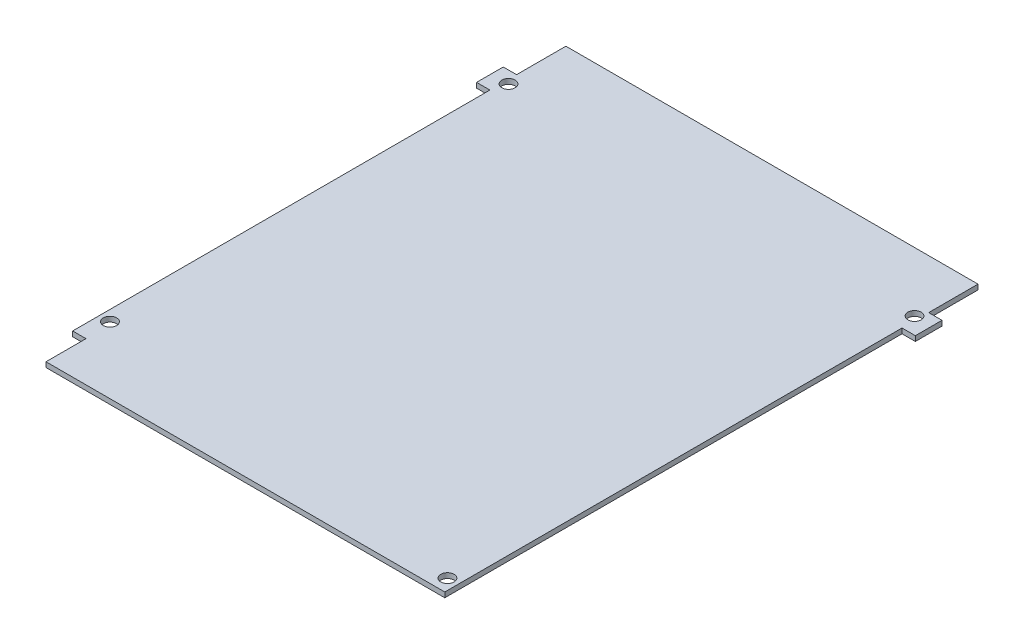
ISO-10303-21;
HEADER;
FILE_DESCRIPTION(('STEP AP214'),'2;1');
FILE_NAME('part.step','',(''),(''),'','','');
FILE_SCHEMA(('AUTOMOTIVE_DESIGN { 1 0 10303 214 1 1 1 1 }'));
ENDSEC;
DATA;
#1=APPLICATION_CONTEXT('core data for automotive mechanical design processes');
#2=APPLICATION_PROTOCOL_DEFINITION('international standard','automotive_design',2000,#1);
#3=PRODUCT_CONTEXT('',#1,'mechanical');
#4=PRODUCT('Part','Part','',(#3));
#5=PRODUCT_RELATED_PRODUCT_CATEGORY('part','',(#4));
#6=PRODUCT_DEFINITION_FORMATION('','',#4);
#7=PRODUCT_DEFINITION_CONTEXT('part definition',#1,'design');
#8=PRODUCT_DEFINITION('design','',#6,#7);
#9=PRODUCT_DEFINITION_SHAPE('','',#8);
#10=(LENGTH_UNIT() NAMED_UNIT(*) SI_UNIT(.MILLI.,.METRE.));
#11=(NAMED_UNIT(*) PLANE_ANGLE_UNIT() SI_UNIT($,.RADIAN.));
#12=(NAMED_UNIT(*) SI_UNIT($,.STERADIAN.) SOLID_ANGLE_UNIT());
#13=UNCERTAINTY_MEASURE_WITH_UNIT(LENGTH_MEASURE(1.E-05),#10,'distance_accuracy_value','');
#14=(GEOMETRIC_REPRESENTATION_CONTEXT(3) GLOBAL_UNCERTAINTY_ASSIGNED_CONTEXT((#13)) GLOBAL_UNIT_ASSIGNED_CONTEXT((#10,
#11,#12)) REPRESENTATION_CONTEXT('',''));
#15=CARTESIAN_POINT('',(0.,0.,0.));
#16=DIRECTION('',(0.,0.,1.));
#17=DIRECTION('',(1.,0.,0.));
#18=AXIS2_PLACEMENT_3D('',#15,#16,#17);
#19=CARTESIAN_POINT('',(-111.528776978417,-1.89738,-52.7517985611511));
#20=DIRECTION('',(-1.,0.,0.));
#21=DIRECTION('',(0.,0.,1.));
#22=AXIS2_PLACEMENT_3D('',#19,#20,#21);
#23=PLANE('',#22);
#24=DIRECTION('',(0.,0.,1.));
#25=VECTOR('',#24,1.);
#26=CARTESIAN_POINT('',(-111.528776978417,0.,-52.7517985611511));
#27=LINE('',#26,#25);
#28=CARTESIAN_POINT('',(-111.528776978417,0.,-52.7517985611511));
#29=VERTEX_POINT('',#28);
#30=CARTESIAN_POINT('',(-111.528776978417,0.,-34.2517985611511));
#31=VERTEX_POINT('',#30);
#32=EDGE_CURVE('E166',#29,#31,#27,.T.);
#33=ORIENTED_EDGE('',*,*,#32,.F.);
#34=DIRECTION('',(0.,1.,0.));
#35=VECTOR('',#34,1.);
#36=CARTESIAN_POINT('',(-111.528776978417,-1.89738,-52.7517985611511));
#37=LINE('',#36,#35);
#38=CARTESIAN_POINT('',(-111.528776978417,-1.89738,-52.7517985611511));
#39=VERTEX_POINT('',#38);
#40=EDGE_CURVE('E11',#39,#29,#37,.T.);
#41=ORIENTED_EDGE('',*,*,#40,.F.);
#42=DIRECTION('',(0.,0.,1.));
#43=VECTOR('',#42,1.);
#44=CARTESIAN_POINT('',(-111.528776978417,-1.89738,-52.7517985611511));
#45=LINE('',#44,#43);
#46=CARTESIAN_POINT('',(-111.528776978417,-1.89738,-34.2517985611511));
#47=VERTEX_POINT('',#46);
#48=EDGE_CURVE('E198',#39,#47,#45,.T.);
#49=ORIENTED_EDGE('',*,*,#48,.T.);
#50=DIRECTION('',(0.,1.,0.));
#51=VECTOR('',#50,1.);
#52=CARTESIAN_POINT('',(-111.528776978417,-1.89738,-34.2517985611511));
#53=LINE('',#52,#51);
#54=EDGE_CURVE('E40',#47,#31,#53,.T.);
#55=ORIENTED_EDGE('',*,*,#54,.T.);
#56=EDGE_LOOP('',(#33,#41,#49,#55));
#57=FACE_BOUND('',#56,.T.);
#58=ADVANCED_FACE('F37',(#57),#23,.T.);
#59=CARTESIAN_POINT('',(-111.528776978417,-1.89738,-52.7517985611511));
#60=DIRECTION('',(0.,0.,-1.));
#61=DIRECTION('',(-1.,0.,0.));
#62=AXIS2_PLACEMENT_3D('',#59,#60,#61);
#63=PLANE('',#62);
#64=DIRECTION('',(-1.,0.,0.));
#65=VECTOR('',#64,1.);
#66=CARTESIAN_POINT('',(-111.528776978417,0.,-52.7517985611511));
#67=LINE('',#66,#65);
#68=CARTESIAN_POINT('',(43.0412230215827,0.,-52.7517985611511));
#69=VERTEX_POINT('',#68);
#70=EDGE_CURVE('E196',#69,#29,#67,.T.);
#71=ORIENTED_EDGE('',*,*,#70,.F.);
#72=DIRECTION('',(0.,1.,0.));
#73=VECTOR('',#72,1.);
#74=CARTESIAN_POINT('',(43.0412230215827,-1.89738,-52.7517985611511));
#75=LINE('',#74,#73);
#76=CARTESIAN_POINT('',(43.0412230215827,-1.89738,-52.7517985611511));
#77=VERTEX_POINT('',#76);
#78=EDGE_CURVE('E45',#77,#69,#75,.T.);
#79=ORIENTED_EDGE('',*,*,#78,.F.);
#80=DIRECTION('',(-1.,0.,0.));
#81=VECTOR('',#80,1.);
#82=CARTESIAN_POINT('',(-111.528776978417,-1.89738,-52.7517985611511));
#83=LINE('',#82,#81);
#84=EDGE_CURVE('E156',#77,#39,#83,.T.);
#85=ORIENTED_EDGE('',*,*,#84,.T.);
#86=ORIENTED_EDGE('',*,*,#40,.T.);
#87=EDGE_LOOP('',(#71,#79,#85,#86));
#88=FACE_BOUND('',#87,.T.);
#89=ADVANCED_FACE('F217',(#88),#63,.T.);
#90=CARTESIAN_POINT('',(43.0412230215827,-1.89738,-52.7517985611511));
#91=DIRECTION('',(1.,0.,0.));
#92=DIRECTION('',(0.,0.,-1.));
#93=AXIS2_PLACEMENT_3D('',#90,#91,#92);
#94=PLANE('',#93);
#95=DIRECTION('',(0.,0.,-1.));
#96=VECTOR('',#95,1.);
#97=CARTESIAN_POINT('',(43.0412230215827,0.,-52.7517985611511));
#98=LINE('',#97,#96);
#99=CARTESIAN_POINT('',(43.0412230215827,0.,-34.2517985611511));
#100=VERTEX_POINT('',#99);
#101=EDGE_CURVE('E141',#100,#69,#98,.T.);
#102=ORIENTED_EDGE('',*,*,#101,.F.);
#103=DIRECTION('',(0.,1.,0.));
#104=VECTOR('',#103,1.);
#105=CARTESIAN_POINT('',(43.0412230215827,-1.89738,-34.2517985611511));
#106=LINE('',#105,#104);
#107=CARTESIAN_POINT('',(43.0412230215827,-1.89738,-34.2517985611511));
#108=VERTEX_POINT('',#107);
#109=EDGE_CURVE('E135',#108,#100,#106,.T.);
#110=ORIENTED_EDGE('',*,*,#109,.F.);
#111=DIRECTION('',(0.,0.,-1.));
#112=VECTOR('',#111,1.);
#113=CARTESIAN_POINT('',(43.0412230215827,-1.89738,-52.7517985611511));
#114=LINE('',#113,#112);
#115=EDGE_CURVE('E138',#108,#77,#114,.T.);
#116=ORIENTED_EDGE('',*,*,#115,.T.);
#117=ORIENTED_EDGE('',*,*,#78,.T.);
#118=EDGE_LOOP('',(#102,#110,#116,#117));
#119=FACE_BOUND('',#118,.T.);
#120=ADVANCED_FACE('F137',(#119),#94,.T.);
#121=CARTESIAN_POINT('',(43.0412230215827,-1.89738,-34.2517985611511));
#122=DIRECTION('',(0.,0.,-1.));
#123=DIRECTION('',(-1.,0.,0.));
#124=AXIS2_PLACEMENT_3D('',#121,#122,#123);
#125=PLANE('',#124);
#126=DIRECTION('',(-1.,0.,0.));
#127=VECTOR('',#126,1.);
#128=CARTESIAN_POINT('',(43.0412230215827,0.,-34.2517985611511));
#129=LINE('',#128,#127);
#130=CARTESIAN_POINT('',(48.0412230215827,0.,-34.2517985611511));
#131=VERTEX_POINT('',#130);
#132=EDGE_CURVE('E193',#131,#100,#129,.T.);
#133=ORIENTED_EDGE('',*,*,#132,.F.);
#134=DIRECTION('',(0.,1.,0.));
#135=VECTOR('',#134,1.);
#136=CARTESIAN_POINT('',(48.0412230215827,-1.89738,-34.2517985611511));
#137=LINE('',#136,#135);
#138=CARTESIAN_POINT('',(48.0412230215827,-1.89738,-34.2517985611511));
#139=VERTEX_POINT('',#138);
#140=EDGE_CURVE('E146',#139,#131,#137,.T.);
#141=ORIENTED_EDGE('',*,*,#140,.F.);
#142=DIRECTION('',(-1.,0.,0.));
#143=VECTOR('',#142,1.);
#144=CARTESIAN_POINT('',(43.0412230215827,-1.89738,-34.2517985611511));
#145=LINE('',#144,#143);
#146=EDGE_CURVE('E154',#139,#108,#145,.T.);
#147=ORIENTED_EDGE('',*,*,#146,.T.);
#148=ORIENTED_EDGE('',*,*,#109,.T.);
#149=EDGE_LOOP('',(#133,#141,#147,#148));
#150=FACE_BOUND('',#149,.T.);
#151=ADVANCED_FACE('F158',(#150),#125,.T.);
#152=CARTESIAN_POINT('',(48.0412230215827,-1.89738,-34.2517985611511));
#153=DIRECTION('',(1.,0.,0.));
#154=DIRECTION('',(0.,0.,-1.));
#155=AXIS2_PLACEMENT_3D('',#152,#153,#154);
#156=PLANE('',#155);
#157=DIRECTION('',(0.,0.,-1.));
#158=VECTOR('',#157,1.);
#159=CARTESIAN_POINT('',(48.0412230215827,0.,-34.2517985611511));
#160=LINE('',#159,#158);
#161=CARTESIAN_POINT('',(48.0412230215827,0.,-24.2517985611511));
#162=VERTEX_POINT('',#161);
#163=EDGE_CURVE('E190',#162,#131,#160,.T.);
#164=ORIENTED_EDGE('',*,*,#163,.F.);
#165=DIRECTION('',(0.,1.,0.));
#166=VECTOR('',#165,1.);
#167=CARTESIAN_POINT('',(48.0412230215827,-1.89738,-24.2517985611511));
#168=LINE('',#167,#166);
#169=CARTESIAN_POINT('',(48.0412230215827,-1.89738,-24.2517985611511));
#170=VERTEX_POINT('',#169);
#171=EDGE_CURVE('E202',#170,#162,#168,.T.);
#172=ORIENTED_EDGE('',*,*,#171,.F.);
#173=DIRECTION('',(0.,0.,-1.));
#174=VECTOR('',#173,1.);
#175=CARTESIAN_POINT('',(48.0412230215827,-1.89738,-34.2517985611511));
#176=LINE('',#175,#174);
#177=EDGE_CURVE('E159',#170,#139,#176,.T.);
#178=ORIENTED_EDGE('',*,*,#177,.T.);
#179=ORIENTED_EDGE('',*,*,#140,.T.);
#180=EDGE_LOOP('',(#164,#172,#178,#179));
#181=FACE_BOUND('',#180,.T.);
#182=ADVANCED_FACE('F230',(#181),#156,.T.);
#183=CARTESIAN_POINT('',(48.0412230215827,-1.89738,-24.2517985611511));
#184=DIRECTION('',(0.,0.,1.));
#185=DIRECTION('',(1.,0.,0.));
#186=AXIS2_PLACEMENT_3D('',#183,#184,#185);
#187=PLANE('',#186);
#188=DIRECTION('',(1.,0.,0.));
#189=VECTOR('',#188,1.);
#190=CARTESIAN_POINT('',(48.0412230215827,0.,-24.2517985611511));
#191=LINE('',#190,#189);
#192=CARTESIAN_POINT('',(43.0412230215827,0.,-24.2517985611511));
#193=VERTEX_POINT('',#192);
#194=EDGE_CURVE('E187',#193,#162,#191,.T.);
#195=ORIENTED_EDGE('',*,*,#194,.F.);
#196=DIRECTION('',(0.,1.,0.));
#197=VECTOR('',#196,1.);
#198=CARTESIAN_POINT('',(43.0412230215827,-1.89738,-24.2517985611511));
#199=LINE('',#198,#197);
#200=CARTESIAN_POINT('',(43.0412230215827,-1.89738,-24.2517985611511));
#201=VERTEX_POINT('',#200);
#202=EDGE_CURVE('E204',#201,#193,#199,.T.);
#203=ORIENTED_EDGE('',*,*,#202,.F.);
#204=DIRECTION('',(1.,0.,0.));
#205=VECTOR('',#204,1.);
#206=CARTESIAN_POINT('',(48.0412230215827,-1.89738,-24.2517985611511));
#207=LINE('',#206,#205);
#208=EDGE_CURVE('E161',#201,#170,#207,.T.);
#209=ORIENTED_EDGE('',*,*,#208,.T.);
#210=ORIENTED_EDGE('',*,*,#171,.T.);
#211=EDGE_LOOP('',(#195,#203,#209,#210));
#212=FACE_BOUND('',#211,.T.);
#213=ADVANCED_FACE('F233',(#212),#187,.T.);
#214=CARTESIAN_POINT('',(43.0412230215827,-1.89738,-24.2517985611511));
#215=DIRECTION('',(1.,0.,0.));
#216=DIRECTION('',(0.,0.,-1.));
#217=AXIS2_PLACEMENT_3D('',#214,#215,#216);
#218=PLANE('',#217);
#219=DIRECTION('',(0.,0.,-1.));
#220=VECTOR('',#219,1.);
#221=CARTESIAN_POINT('',(43.0412230215827,0.,-24.2517985611511));
#222=LINE('',#221,#220);
#223=CARTESIAN_POINT('',(43.0412230215828,0.,147.248201438849));
#224=VERTEX_POINT('',#223);
#225=EDGE_CURVE('E184',#224,#193,#222,.T.);
#226=ORIENTED_EDGE('',*,*,#225,.F.);
#227=DIRECTION('',(0.,1.,0.));
#228=VECTOR('',#227,1.);
#229=CARTESIAN_POINT('',(43.0412230215828,-1.89738,147.248201438849));
#230=LINE('',#229,#228);
#231=CARTESIAN_POINT('',(43.0412230215828,-1.89738,147.248201438849));
#232=VERTEX_POINT('',#231);
#233=EDGE_CURVE('E206',#232,#224,#230,.T.);
#234=ORIENTED_EDGE('',*,*,#233,.F.);
#235=DIRECTION('',(0.,0.,-1.));
#236=VECTOR('',#235,1.);
#237=CARTESIAN_POINT('',(43.0412230215827,-1.89738,-24.2517985611511));
#238=LINE('',#237,#236);
#239=EDGE_CURVE('E352',#232,#201,#238,.T.);
#240=ORIENTED_EDGE('',*,*,#239,.T.);
#241=ORIENTED_EDGE('',*,*,#202,.T.);
#242=EDGE_LOOP('',(#226,#234,#240,#241));
#243=FACE_BOUND('',#242,.T.);
#244=ADVANCED_FACE('F237',(#243),#218,.T.);
#245=CARTESIAN_POINT('',(-111.528776978417,-1.89738,147.248201438849));
#246=DIRECTION('',(0.,0.,1.));
#247=DIRECTION('',(1.,0.,0.));
#248=AXIS2_PLACEMENT_3D('',#245,#246,#247);
#249=PLANE('',#248);
#250=DIRECTION('',(0.,1.,0.));
#251=VECTOR('',#250,1.);
#252=CARTESIAN_POINT('',(-106.528776978417,-10.,147.248201438849));
#253=LINE('',#252,#251);
#254=CARTESIAN_POINT('',(-106.528776978417,-1.89738,147.248201438849));
#255=VERTEX_POINT('',#254);
#256=CARTESIAN_POINT('',(-106.528776978417,0.,147.248201438849));
#257=VERTEX_POINT('',#256);
#258=EDGE_CURVE('E53',#255,#257,#253,.T.);
#259=ORIENTED_EDGE('',*,*,#258,.F.);
#260=DIRECTION('',(1.,0.,0.));
#261=VECTOR('',#260,1.);
#262=CARTESIAN_POINT('',(-111.528776978417,-1.89738,147.248201438849));
#263=LINE('',#262,#261);
#264=EDGE_CURVE('E313',#255,#232,#263,.T.);
#265=ORIENTED_EDGE('',*,*,#264,.T.);
#266=ORIENTED_EDGE('',*,*,#233,.T.);
#267=DIRECTION('',(1.,0.,0.));
#268=VECTOR('',#267,1.);
#269=CARTESIAN_POINT('',(-111.528776978417,0.,147.248201438849));
#270=LINE('',#269,#268);
#271=EDGE_CURVE('E182',#257,#224,#270,.T.);
#272=ORIENTED_EDGE('',*,*,#271,.F.);
#273=EDGE_LOOP('',(#259,#265,#266,#272));
#274=FACE_BOUND('',#273,.T.);
#275=ADVANCED_FACE('F241',(#274),#249,.T.);
#276=CARTESIAN_POINT('',(-111.528776978417,-1.89738,-24.2517985611511));
#277=DIRECTION('',(-1.,0.,0.));
#278=DIRECTION('',(0.,0.,1.));
#279=AXIS2_PLACEMENT_3D('',#276,#277,#278);
#280=PLANE('',#279);
#281=DIRECTION('',(0.,1.,0.));
#282=VECTOR('',#281,1.);
#283=CARTESIAN_POINT('',(-111.528776978417,-10.,132.248201438849));
#284=LINE('',#283,#282);
#285=CARTESIAN_POINT('',(-111.528776978417,-1.89738,132.248201438849));
#286=VERTEX_POINT('',#285);
#287=CARTESIAN_POINT('',(-111.528776978417,0.,132.248201438849));
#288=VERTEX_POINT('',#287);
#289=EDGE_CURVE('E300',#286,#288,#284,.T.);
#290=ORIENTED_EDGE('',*,*,#289,.T.);
#291=DIRECTION('',(0.,0.,1.));
#292=VECTOR('',#291,1.);
#293=CARTESIAN_POINT('',(-111.528776978417,0.,-24.2517985611511));
#294=LINE('',#293,#292);
#295=CARTESIAN_POINT('',(-111.528776978417,0.,-24.2517985611511));
#296=VERTEX_POINT('',#295);
#297=EDGE_CURVE('E179',#296,#288,#294,.T.);
#298=ORIENTED_EDGE('',*,*,#297,.F.);
#299=DIRECTION('',(0.,1.,0.));
#300=VECTOR('',#299,1.);
#301=CARTESIAN_POINT('',(-111.528776978417,-1.89738,-24.2517985611511));
#302=LINE('',#301,#300);
#303=CARTESIAN_POINT('',(-111.528776978417,-1.89738,-24.2517985611511));
#304=VERTEX_POINT('',#303);
#305=EDGE_CURVE('E209',#304,#296,#302,.T.);
#306=ORIENTED_EDGE('',*,*,#305,.F.);
#307=DIRECTION('',(0.,0.,1.));
#308=VECTOR('',#307,1.);
#309=CARTESIAN_POINT('',(-111.528776978417,-1.89738,-24.2517985611511));
#310=LINE('',#309,#308);
#311=EDGE_CURVE('E349',#304,#286,#310,.T.);
#312=ORIENTED_EDGE('',*,*,#311,.T.);
#313=EDGE_LOOP('',(#290,#298,#306,#312));
#314=FACE_BOUND('',#313,.T.);
#315=ADVANCED_FACE('F245',(#314),#280,.T.);
#316=CARTESIAN_POINT('',(-116.528776978417,-1.89738,-24.2517985611511));
#317=DIRECTION('',(0.,0.,1.));
#318=DIRECTION('',(1.,0.,0.));
#319=AXIS2_PLACEMENT_3D('',#316,#317,#318);
#320=PLANE('',#319);
#321=DIRECTION('',(1.,0.,0.));
#322=VECTOR('',#321,1.);
#323=CARTESIAN_POINT('',(-116.528776978417,0.,-24.2517985611511));
#324=LINE('',#323,#322);
#325=CARTESIAN_POINT('',(-116.528776978417,0.,-24.2517985611511));
#326=VERTEX_POINT('',#325);
#327=EDGE_CURVE('E176',#326,#296,#324,.T.);
#328=ORIENTED_EDGE('',*,*,#327,.F.);
#329=DIRECTION('',(0.,1.,0.));
#330=VECTOR('',#329,1.);
#331=CARTESIAN_POINT('',(-116.528776978417,-1.89738,-24.2517985611511));
#332=LINE('',#331,#330);
#333=CARTESIAN_POINT('',(-116.528776978417,-1.89738,-24.2517985611511));
#334=VERTEX_POINT('',#333);
#335=EDGE_CURVE('E211',#334,#326,#332,.T.);
#336=ORIENTED_EDGE('',*,*,#335,.F.);
#337=DIRECTION('',(1.,0.,0.));
#338=VECTOR('',#337,1.);
#339=CARTESIAN_POINT('',(-116.528776978417,-1.89738,-24.2517985611511));
#340=LINE('',#339,#338);
#341=EDGE_CURVE('E346',#334,#304,#340,.T.);
#342=ORIENTED_EDGE('',*,*,#341,.T.);
#343=ORIENTED_EDGE('',*,*,#305,.T.);
#344=EDGE_LOOP('',(#328,#336,#342,#343));
#345=FACE_BOUND('',#344,.T.);
#346=ADVANCED_FACE('F249',(#345),#320,.T.);
#347=CARTESIAN_POINT('',(-116.528776978417,-1.89738,-34.2517985611511));
#348=DIRECTION('',(-1.,0.,0.));
#349=DIRECTION('',(0.,0.,1.));
#350=AXIS2_PLACEMENT_3D('',#347,#348,#349);
#351=PLANE('',#350);
#352=DIRECTION('',(0.,0.,1.));
#353=VECTOR('',#352,1.);
#354=CARTESIAN_POINT('',(-116.528776978417,0.,-34.2517985611511));
#355=LINE('',#354,#353);
#356=CARTESIAN_POINT('',(-116.528776978417,0.,-34.2517985611511));
#357=VERTEX_POINT('',#356);
#358=EDGE_CURVE('E173',#357,#326,#355,.T.);
#359=ORIENTED_EDGE('',*,*,#358,.F.);
#360=DIRECTION('',(0.,1.,0.));
#361=VECTOR('',#360,1.);
#362=CARTESIAN_POINT('',(-116.528776978417,-1.89738,-34.2517985611511));
#363=LINE('',#362,#361);
#364=CARTESIAN_POINT('',(-116.528776978417,-1.89738,-34.2517985611511));
#365=VERTEX_POINT('',#364);
#366=EDGE_CURVE('E212',#365,#357,#363,.T.);
#367=ORIENTED_EDGE('',*,*,#366,.F.);
#368=DIRECTION('',(0.,0.,1.));
#369=VECTOR('',#368,1.);
#370=CARTESIAN_POINT('',(-116.528776978417,-1.89738,-34.2517985611511));
#371=LINE('',#370,#369);
#372=EDGE_CURVE('E343',#365,#334,#371,.T.);
#373=ORIENTED_EDGE('',*,*,#372,.T.);
#374=ORIENTED_EDGE('',*,*,#335,.T.);
#375=EDGE_LOOP('',(#359,#367,#373,#374));
#376=FACE_BOUND('',#375,.T.);
#377=ADVANCED_FACE('F253',(#376),#351,.T.);
#378=CARTESIAN_POINT('',(-111.528776978417,-1.89738,-34.2517985611511));
#379=DIRECTION('',(0.,0.,-1.));
#380=DIRECTION('',(-1.,0.,0.));
#381=AXIS2_PLACEMENT_3D('',#378,#379,#380);
#382=PLANE('',#381);
#383=DIRECTION('',(-1.,0.,0.));
#384=VECTOR('',#383,1.);
#385=CARTESIAN_POINT('',(-111.528776978417,0.,-34.2517985611511));
#386=LINE('',#385,#384);
#387=EDGE_CURVE('E169',#31,#357,#386,.T.);
#388=ORIENTED_EDGE('',*,*,#387,.F.);
#389=ORIENTED_EDGE('',*,*,#54,.F.);
#390=DIRECTION('',(-1.,0.,0.));
#391=VECTOR('',#390,1.);
#392=CARTESIAN_POINT('',(-111.528776978417,-1.89738,-34.2517985611511));
#393=LINE('',#392,#391);
#394=EDGE_CURVE('E341',#47,#365,#393,.T.);
#395=ORIENTED_EDGE('',*,*,#394,.T.);
#396=ORIENTED_EDGE('',*,*,#366,.T.);
#397=EDGE_LOOP('',(#388,#389,#395,#396));
#398=FACE_BOUND('',#397,.T.);
#399=ADVANCED_FACE('F214',(#398),#382,.T.);
#400=CARTESIAN_POINT('',(0.,-1.89738,0.));
#401=DIRECTION('',(0.,-1.,0.));
#402=DIRECTION('',(0.,0.,-1.));
#403=AXIS2_PLACEMENT_3D('',#400,#401,#402);
#404=PLANE('',#403);
#405=DIRECTION('',(1.,0.,0.));
#406=VECTOR('',#405,1.);
#407=CARTESIAN_POINT('',(0.,-1.89738,132.248201438849));
#408=LINE('',#407,#406);
#409=CARTESIAN_POINT('',(-106.528776978417,-1.89738,132.248201438849));
#410=VERTEX_POINT('',#409);
#411=EDGE_CURVE('E294',#286,#410,#408,.T.);
#412=ORIENTED_EDGE('',*,*,#411,.F.);
#413=ORIENTED_EDGE('',*,*,#311,.F.);
#414=ORIENTED_EDGE('',*,*,#341,.F.);
#415=ORIENTED_EDGE('',*,*,#372,.F.);
#416=ORIENTED_EDGE('',*,*,#394,.F.);
#417=ORIENTED_EDGE('',*,*,#48,.F.);
#418=ORIENTED_EDGE('',*,*,#84,.F.);
#419=ORIENTED_EDGE('',*,*,#115,.F.);
#420=ORIENTED_EDGE('',*,*,#146,.F.);
#421=ORIENTED_EDGE('',*,*,#177,.F.);
#422=ORIENTED_EDGE('',*,*,#208,.F.);
#423=ORIENTED_EDGE('',*,*,#239,.F.);
#424=ORIENTED_EDGE('',*,*,#264,.F.);
#425=DIRECTION('',(0.,0.,1.));
#426=VECTOR('',#425,1.);
#427=CARTESIAN_POINT('',(-106.528776978417,-1.89738,0.));
#428=LINE('',#427,#426);
#429=EDGE_CURVE('E306',#410,#255,#428,.T.);
#430=ORIENTED_EDGE('',*,*,#429,.F.);
#431=EDGE_LOOP('',(#412,#413,#414,#415,#416,#417,#418,#419,#420,#421,#422,#423,#424,#430));
#432=FACE_BOUND('',#431,.T.);
#433=CARTESIAN_POINT('',(41.5035280646399,-1.89738,-30.5034455289963));
#434=DIRECTION('',(0.,-1.,0.));
#435=DIRECTION('',(0.,0.,-1.));
#436=AXIS2_PLACEMENT_3D('',#433,#434,#435);
#437=CIRCLE('',#436,2.5);
#438=CARTESIAN_POINT('',(41.5035280646399,-1.89738,-33.0034455289963));
#439=VERTEX_POINT('',#438);
#440=EDGE_CURVE('E305',#439,#439,#437,.T.);
#441=ORIENTED_EDGE('',*,*,#440,.F.);
#442=EDGE_LOOP('',(#441));
#443=FACE_BOUND('',#442,.T.);
#444=CARTESIAN_POINT('',(-110.028776978417,-1.89738,-29.7299703376165));
#445=DIRECTION('',(0.,-1.,0.));
#446=DIRECTION('',(0.,0.,-1.));
#447=AXIS2_PLACEMENT_3D('',#444,#445,#446);
#448=CIRCLE('',#447,2.5);
#449=CARTESIAN_POINT('',(-110.028776978417,-1.89738,-32.2299703376165));
#450=VERTEX_POINT('',#449);
#451=EDGE_CURVE('E321',#450,#450,#448,.T.);
#452=ORIENTED_EDGE('',*,*,#451,.F.);
#453=EDGE_LOOP('',(#452));
#454=FACE_BOUND('',#453,.T.);
#455=CARTESIAN_POINT('',(39.0412230215828,-1.89738,142.248201438849));
#456=DIRECTION('',(0.,-1.,0.));
#457=DIRECTION('',(0.,0.,-1.));
#458=AXIS2_PLACEMENT_3D('',#455,#456,#457);
#459=CIRCLE('',#458,2.5);
#460=CARTESIAN_POINT('',(39.0412230215828,-1.89738,139.748201438849));
#461=VERTEX_POINT('',#460);
#462=EDGE_CURVE('E327',#461,#461,#459,.T.);
#463=ORIENTED_EDGE('',*,*,#462,.F.);
#464=EDGE_LOOP('',(#463));
#465=FACE_BOUND('',#464,.T.);
#466=CARTESIAN_POINT('',(-107.528776978417,-1.89738,122.248201438849));
#467=DIRECTION('',(0.,-1.,0.));
#468=DIRECTION('',(0.,0.,-1.));
#469=AXIS2_PLACEMENT_3D('',#466,#467,#468);
#470=CIRCLE('',#469,2.5);
#471=CARTESIAN_POINT('',(-107.528776978417,-1.89738,119.748201438849));
#472=VERTEX_POINT('',#471);
#473=EDGE_CURVE('E333',#472,#472,#470,.T.);
#474=ORIENTED_EDGE('',*,*,#473,.F.);
#475=EDGE_LOOP('',(#474));
#476=FACE_BOUND('',#475,.T.);
#477=ADVANCED_FACE('F151',(#432,#443,#454,#465,#476),#404,.T.);
#478=CARTESIAN_POINT('',(0.,0.,0.));
#479=DIRECTION('',(0.,-1.,0.));
#480=DIRECTION('',(0.,0.,-1.));
#481=AXIS2_PLACEMENT_3D('',#478,#479,#480);
#482=PLANE('',#481);
#483=CARTESIAN_POINT('',(41.5035280646399,0.,-30.5034455289963));
#484=DIRECTION('',(0.,-1.,0.));
#485=DIRECTION('',(0.,0.,-1.));
#486=AXIS2_PLACEMENT_3D('',#483,#484,#485);
#487=CIRCLE('',#486,2.5);
#488=CARTESIAN_POINT('',(41.5035280646399,0.,-33.0034455289963));
#489=VERTEX_POINT('',#488);
#490=EDGE_CURVE('E318',#489,#489,#487,.T.);
#491=ORIENTED_EDGE('',*,*,#490,.T.);
#492=EDGE_LOOP('',(#491));
#493=FACE_BOUND('',#492,.T.);
#494=CARTESIAN_POINT('',(-110.028776978417,0.,-29.7299703376165));
#495=DIRECTION('',(0.,-1.,0.));
#496=DIRECTION('',(0.,0.,-1.));
#497=AXIS2_PLACEMENT_3D('',#494,#495,#496);
#498=CIRCLE('',#497,2.5);
#499=CARTESIAN_POINT('',(-110.028776978417,0.,-32.2299703376165));
#500=VERTEX_POINT('',#499);
#501=EDGE_CURVE('E324',#500,#500,#498,.T.);
#502=ORIENTED_EDGE('',*,*,#501,.T.);
#503=EDGE_LOOP('',(#502));
#504=FACE_BOUND('',#503,.T.);
#505=CARTESIAN_POINT('',(39.0412230215828,0.,142.248201438849));
#506=DIRECTION('',(0.,-1.,0.));
#507=DIRECTION('',(0.,0.,-1.));
#508=AXIS2_PLACEMENT_3D('',#505,#506,#507);
#509=CIRCLE('',#508,2.5);
#510=CARTESIAN_POINT('',(39.0412230215828,0.,139.748201438849));
#511=VERTEX_POINT('',#510);
#512=EDGE_CURVE('E330',#511,#511,#509,.T.);
#513=ORIENTED_EDGE('',*,*,#512,.T.);
#514=EDGE_LOOP('',(#513));
#515=FACE_BOUND('',#514,.T.);
#516=CARTESIAN_POINT('',(-107.528776978417,0.,122.248201438849));
#517=DIRECTION('',(0.,-1.,0.));
#518=DIRECTION('',(0.,0.,-1.));
#519=AXIS2_PLACEMENT_3D('',#516,#517,#518);
#520=CIRCLE('',#519,2.5);
#521=CARTESIAN_POINT('',(-107.528776978417,0.,119.748201438849));
#522=VERTEX_POINT('',#521);
#523=EDGE_CURVE('E170',#522,#522,#520,.T.);
#524=ORIENTED_EDGE('',*,*,#523,.T.);
#525=EDGE_LOOP('',(#524));
#526=FACE_BOUND('',#525,.T.);
#527=ORIENTED_EDGE('',*,*,#297,.T.);
#528=DIRECTION('',(-1.,0.,0.));
#529=VECTOR('',#528,1.);
#530=CARTESIAN_POINT('',(-111.528776978417,0.,132.248201438849));
#531=LINE('',#530,#529);
#532=CARTESIAN_POINT('',(-106.528776978417,0.,132.248201438849));
#533=VERTEX_POINT('',#532);
#534=EDGE_CURVE('E363',#533,#288,#531,.T.);
#535=ORIENTED_EDGE('',*,*,#534,.F.);
#536=DIRECTION('',(0.,0.,-1.));
#537=VECTOR('',#536,1.);
#538=CARTESIAN_POINT('',(-106.528776978417,0.,132.248201438849));
#539=LINE('',#538,#537);
#540=EDGE_CURVE('E308',#257,#533,#539,.T.);
#541=ORIENTED_EDGE('',*,*,#540,.F.);
#542=ORIENTED_EDGE('',*,*,#271,.T.);
#543=ORIENTED_EDGE('',*,*,#225,.T.);
#544=ORIENTED_EDGE('',*,*,#194,.T.);
#545=ORIENTED_EDGE('',*,*,#163,.T.);
#546=ORIENTED_EDGE('',*,*,#132,.T.);
#547=ORIENTED_EDGE('',*,*,#101,.T.);
#548=ORIENTED_EDGE('',*,*,#70,.T.);
#549=ORIENTED_EDGE('',*,*,#32,.T.);
#550=ORIENTED_EDGE('',*,*,#387,.T.);
#551=ORIENTED_EDGE('',*,*,#358,.T.);
#552=ORIENTED_EDGE('',*,*,#327,.T.);
#553=EDGE_LOOP('',(#527,#535,#541,#542,#543,#544,#545,#546,#547,#548,#549,#550,#551,#552));
#554=FACE_BOUND('',#553,.T.);
#555=ADVANCED_FACE('F216',(#493,#504,#515,#526,#554),#482,.F.);
#556=CARTESIAN_POINT('',(-107.528776978417,0.,122.248201438849));
#557=DIRECTION('',(0.,-1.,0.));
#558=DIRECTION('',(0.,0.,-1.));
#559=AXIS2_PLACEMENT_3D('',#556,#557,#558);
#560=CYLINDRICAL_SURFACE('',#559,2.5);
#561=ORIENTED_EDGE('',*,*,#523,.F.);
#562=EDGE_LOOP('',(#561));
#563=FACE_BOUND('',#562,.T.);
#564=ORIENTED_EDGE('',*,*,#473,.T.);
#565=EDGE_LOOP('',(#564));
#566=FACE_BOUND('',#565,.T.);
#567=ADVANCED_FACE('F264',(#563,#566),#560,.F.);
#568=CARTESIAN_POINT('',(39.0412230215828,0.,142.248201438849));
#569=DIRECTION('',(0.,-1.,0.));
#570=DIRECTION('',(0.,0.,-1.));
#571=AXIS2_PLACEMENT_3D('',#568,#569,#570);
#572=CYLINDRICAL_SURFACE('',#571,2.5);
#573=ORIENTED_EDGE('',*,*,#512,.F.);
#574=EDGE_LOOP('',(#573));
#575=FACE_BOUND('',#574,.T.);
#576=ORIENTED_EDGE('',*,*,#462,.T.);
#577=EDGE_LOOP('',(#576));
#578=FACE_BOUND('',#577,.T.);
#579=ADVANCED_FACE('F269',(#575,#578),#572,.F.);
#580=CARTESIAN_POINT('',(-110.028776978417,0.,-29.7299703376165));
#581=DIRECTION('',(0.,-1.,0.));
#582=DIRECTION('',(0.,0.,-1.));
#583=AXIS2_PLACEMENT_3D('',#580,#581,#582);
#584=CYLINDRICAL_SURFACE('',#583,2.5);
#585=ORIENTED_EDGE('',*,*,#501,.F.);
#586=EDGE_LOOP('',(#585));
#587=FACE_BOUND('',#586,.T.);
#588=ORIENTED_EDGE('',*,*,#451,.T.);
#589=EDGE_LOOP('',(#588));
#590=FACE_BOUND('',#589,.T.);
#591=ADVANCED_FACE('F273',(#587,#590),#584,.F.);
#592=CARTESIAN_POINT('',(41.5035280646399,0.,-30.5034455289963));
#593=DIRECTION('',(0.,-1.,0.));
#594=DIRECTION('',(0.,0.,-1.));
#595=AXIS2_PLACEMENT_3D('',#592,#593,#594);
#596=CYLINDRICAL_SURFACE('',#595,2.5);
#597=ORIENTED_EDGE('',*,*,#490,.F.);
#598=EDGE_LOOP('',(#597));
#599=FACE_BOUND('',#598,.T.);
#600=ORIENTED_EDGE('',*,*,#440,.T.);
#601=EDGE_LOOP('',(#600));
#602=FACE_BOUND('',#601,.T.);
#603=ADVANCED_FACE('F277',(#599,#602),#596,.F.);
#604=CARTESIAN_POINT('',(-111.528776978417,-10.,132.248201438849));
#605=DIRECTION('',(0.,0.,-1.));
#606=DIRECTION('',(-1.,0.,0.));
#607=AXIS2_PLACEMENT_3D('',#604,#605,#606);
#608=PLANE('',#607);
#609=ORIENTED_EDGE('',*,*,#411,.T.);
#610=DIRECTION('',(0.,1.,0.));
#611=VECTOR('',#610,1.);
#612=CARTESIAN_POINT('',(-106.528776978417,-10.,132.248201438849));
#613=LINE('',#612,#611);
#614=EDGE_CURVE('E298',#410,#533,#613,.T.);
#615=ORIENTED_EDGE('',*,*,#614,.T.);
#616=ORIENTED_EDGE('',*,*,#534,.T.);
#617=ORIENTED_EDGE('',*,*,#289,.F.);
#618=EDGE_LOOP('',(#609,#615,#616,#617));
#619=FACE_BOUND('',#618,.T.);
#620=ADVANCED_FACE('F281',(#619),#608,.F.);
#621=CARTESIAN_POINT('',(-106.528776978417,-10.,132.248201438849));
#622=DIRECTION('',(1.,0.,0.));
#623=DIRECTION('',(0.,0.,-1.));
#624=AXIS2_PLACEMENT_3D('',#621,#622,#623);
#625=PLANE('',#624);
#626=ORIENTED_EDGE('',*,*,#429,.T.);
#627=ORIENTED_EDGE('',*,*,#258,.T.);
#628=ORIENTED_EDGE('',*,*,#540,.T.);
#629=ORIENTED_EDGE('',*,*,#614,.F.);
#630=EDGE_LOOP('',(#626,#627,#628,#629));
#631=FACE_BOUND('',#630,.T.);
#632=ADVANCED_FACE('F283',(#631),#625,.F.);
#633=CLOSED_SHELL('',(#58,#89,#120,#151,#182,#213,#244,#275,#315,#346,#377,#399,#477,#555,#567,
#579,#591,#603,#620,#632));
#634=MANIFOLD_SOLID_BREP('B2',#633);
#635=ADVANCED_BREP_SHAPE_REPRESENTATION('',(#18,#634),#14);
#636=SHAPE_DEFINITION_REPRESENTATION(#9,#635);
ENDSEC;
END-ISO-10303-21;
